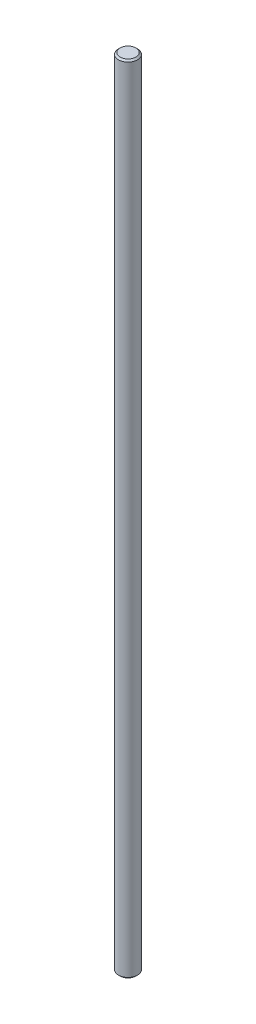
ISO-10303-21;
HEADER;
FILE_DESCRIPTION(('STEP AP214'),'2;1');
FILE_NAME('part.step','',(''),(''),'','','');
FILE_SCHEMA(('AUTOMOTIVE_DESIGN { 1 0 10303 214 1 1 1 1 }'));
ENDSEC;
DATA;
#1=APPLICATION_CONTEXT('core data for automotive mechanical design processes');
#2=APPLICATION_PROTOCOL_DEFINITION('international standard','automotive_design',2000,#1);
#3=PRODUCT_CONTEXT('',#1,'mechanical');
#4=PRODUCT('Part','Part','',(#3));
#5=PRODUCT_RELATED_PRODUCT_CATEGORY('part','',(#4));
#6=PRODUCT_DEFINITION_FORMATION('','',#4);
#7=PRODUCT_DEFINITION_CONTEXT('part definition',#1,'design');
#8=PRODUCT_DEFINITION('design','',#6,#7);
#9=PRODUCT_DEFINITION_SHAPE('','',#8);
#10=(LENGTH_UNIT() NAMED_UNIT(*) SI_UNIT(.MILLI.,.METRE.));
#11=(NAMED_UNIT(*) PLANE_ANGLE_UNIT() SI_UNIT($,.RADIAN.));
#12=(NAMED_UNIT(*) SI_UNIT($,.STERADIAN.) SOLID_ANGLE_UNIT());
#13=UNCERTAINTY_MEASURE_WITH_UNIT(LENGTH_MEASURE(1.E-05),#10,'distance_accuracy_value','');
#14=(GEOMETRIC_REPRESENTATION_CONTEXT(3) GLOBAL_UNCERTAINTY_ASSIGNED_CONTEXT((#13)) GLOBAL_UNIT_ASSIGNED_CONTEXT((#10,
#11,#12)) REPRESENTATION_CONTEXT('',''));
#15=CARTESIAN_POINT('',(0.,0.,0.));
#16=DIRECTION('',(0.,0.,1.));
#17=DIRECTION('',(1.,0.,0.));
#18=AXIS2_PLACEMENT_3D('',#15,#16,#17);
#19=CARTESIAN_POINT('',(0.,250.,0.));
#20=DIRECTION('',(0.,-1.,0.));
#21=DIRECTION('',(0.,0.,-1.));
#22=AXIS2_PLACEMENT_3D('',#19,#20,#21);
#23=CYLINDRICAL_SURFACE('',#22,3.);
#24=CARTESIAN_POINT('',(0.,249.5,0.));
#25=DIRECTION('',(0.,1.,0.));
#26=DIRECTION('',(0.,0.,1.));
#27=AXIS2_PLACEMENT_3D('',#24,#25,#26);
#28=CIRCLE('',#27,3.);
#29=CARTESIAN_POINT('',(0.,249.5,3.));
#30=VERTEX_POINT('',#29);
#31=EDGE_CURVE('E42',#30,#30,#28,.F.);
#32=ORIENTED_EDGE('',*,*,#31,.T.);
#33=EDGE_LOOP('',(#32));
#34=FACE_BOUND('',#33,.T.);
#35=CARTESIAN_POINT('',(0.,0.500000000000028,0.));
#36=DIRECTION('',(0.,1.,0.));
#37=DIRECTION('',(0.,0.,1.));
#38=AXIS2_PLACEMENT_3D('',#35,#36,#37);
#39=CIRCLE('',#38,3.);
#40=CARTESIAN_POINT('',(0.,0.500000000000028,3.));
#41=VERTEX_POINT('',#40);
#42=EDGE_CURVE('E46',#41,#41,#39,.T.);
#43=ORIENTED_EDGE('',*,*,#42,.T.);
#44=EDGE_LOOP('',(#43));
#45=FACE_BOUND('',#44,.T.);
#46=ADVANCED_FACE('F35',(#34,#45),#23,.T.);
#47=CARTESIAN_POINT('',(0.,250.,0.));
#48=DIRECTION('',(0.,1.,0.));
#49=DIRECTION('',(0.,0.,1.));
#50=AXIS2_PLACEMENT_3D('',#47,#48,#49);
#51=PLANE('',#50);
#52=CARTESIAN_POINT('',(0.,250.,0.));
#53=DIRECTION('',(0.,1.,0.));
#54=DIRECTION('',(0.,0.,1.));
#55=AXIS2_PLACEMENT_3D('',#52,#53,#54);
#56=CIRCLE('',#55,2.49999999999997);
#57=CARTESIAN_POINT('',(0.,250.,2.49999999999997));
#58=VERTEX_POINT('',#57);
#59=EDGE_CURVE('E50',#58,#58,#56,.T.);
#60=ORIENTED_EDGE('',*,*,#59,.T.);
#61=EDGE_LOOP('',(#60));
#62=FACE_BOUND('',#61,.T.);
#63=ADVANCED_FACE('F56',(#62),#51,.T.);
#64=CARTESIAN_POINT('',(0.,0.,0.));
#65=DIRECTION('',(0.,1.,0.));
#66=DIRECTION('',(0.,0.,1.));
#67=AXIS2_PLACEMENT_3D('',#64,#65,#66);
#68=PLANE('',#67);
#69=CARTESIAN_POINT('',(0.,0.,0.));
#70=DIRECTION('',(0.,1.,0.));
#71=DIRECTION('',(0.,0.,1.));
#72=AXIS2_PLACEMENT_3D('',#69,#70,#71);
#73=CIRCLE('',#72,2.49999999999997);
#74=CARTESIAN_POINT('',(0.,0.,2.49999999999997));
#75=VERTEX_POINT('',#74);
#76=EDGE_CURVE('E10',#75,#75,#73,.F.);
#77=ORIENTED_EDGE('',*,*,#76,.T.);
#78=EDGE_LOOP('',(#77));
#79=FACE_BOUND('',#78,.T.);
#80=ADVANCED_FACE('F60',(#79),#68,.F.);
#81=CARTESIAN_POINT('',(0.,250.,0.));
#82=DIRECTION('',(0.,-1.,0.));
#83=DIRECTION('',(0.,0.,-1.));
#84=AXIS2_PLACEMENT_3D('',#81,#82,#83);
#85=CONICAL_SURFACE('',#84,2.49999999999997,0.785398163397473);
#86=ORIENTED_EDGE('',*,*,#31,.F.);
#87=EDGE_LOOP('',(#86));
#88=FACE_BOUND('',#87,.T.);
#89=ORIENTED_EDGE('',*,*,#59,.F.);
#90=EDGE_LOOP('',(#89));
#91=FACE_BOUND('',#90,.T.);
#92=ADVANCED_FACE('F58',(#88,#91),#85,.T.);
#93=CARTESIAN_POINT('',(0.,0.500000000000028,0.));
#94=DIRECTION('',(0.,1.,0.));
#95=DIRECTION('',(0.,0.,1.));
#96=AXIS2_PLACEMENT_3D('',#93,#94,#95);
#97=CONICAL_SURFACE('',#96,3.,0.785398163397445);
#98=ORIENTED_EDGE('',*,*,#76,.F.);
#99=EDGE_LOOP('',(#98));
#100=FACE_BOUND('',#99,.T.);
#101=ORIENTED_EDGE('',*,*,#42,.F.);
#102=EDGE_LOOP('',(#101));
#103=FACE_BOUND('',#102,.T.);
#104=ADVANCED_FACE('F37',(#100,#103),#97,.T.);
#105=CLOSED_SHELL('',(#46,#63,#80,#92,#104));
#106=MANIFOLD_SOLID_BREP('B2',#105);
#107=ADVANCED_BREP_SHAPE_REPRESENTATION('',(#18,#106),#14);
#108=SHAPE_DEFINITION_REPRESENTATION(#9,#107);
ENDSEC;
END-ISO-10303-21;
